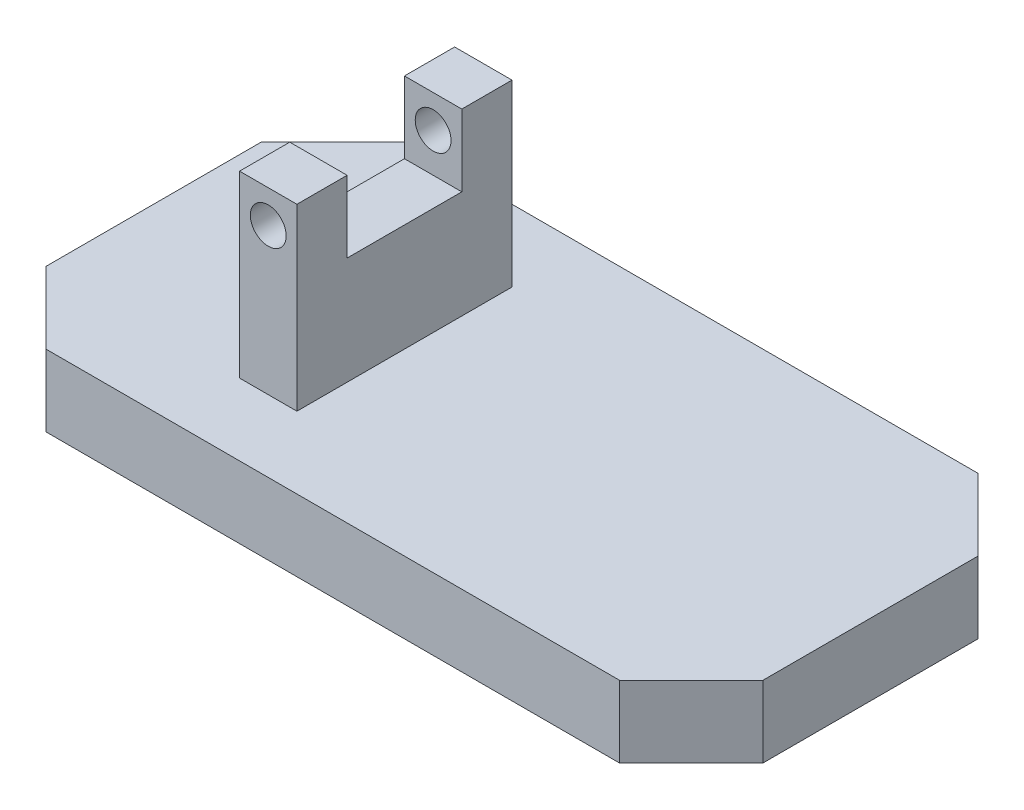
ISO-10303-21;
HEADER;
FILE_DESCRIPTION(('STEP AP214'),'2;1');
FILE_NAME('part.step','',(''),(''),'','','');
FILE_SCHEMA(('AUTOMOTIVE_DESIGN { 1 0 10303 214 1 1 1 1 }'));
ENDSEC;
DATA;
#1=APPLICATION_CONTEXT('core data for automotive mechanical design processes');
#2=APPLICATION_PROTOCOL_DEFINITION('international standard','automotive_design',2000,#1);
#3=PRODUCT_CONTEXT('',#1,'mechanical');
#4=PRODUCT('Part','Part','',(#3));
#5=PRODUCT_RELATED_PRODUCT_CATEGORY('part','',(#4));
#6=PRODUCT_DEFINITION_FORMATION('','',#4);
#7=PRODUCT_DEFINITION_CONTEXT('part definition',#1,'design');
#8=PRODUCT_DEFINITION('design','',#6,#7);
#9=PRODUCT_DEFINITION_SHAPE('','',#8);
#10=(LENGTH_UNIT() NAMED_UNIT(*) SI_UNIT(.MILLI.,.METRE.));
#11=(NAMED_UNIT(*) PLANE_ANGLE_UNIT() SI_UNIT($,.RADIAN.));
#12=(NAMED_UNIT(*) SI_UNIT($,.STERADIAN.) SOLID_ANGLE_UNIT());
#13=UNCERTAINTY_MEASURE_WITH_UNIT(LENGTH_MEASURE(1.E-05),#10,'distance_accuracy_value','');
#14=(GEOMETRIC_REPRESENTATION_CONTEXT(3) GLOBAL_UNCERTAINTY_ASSIGNED_CONTEXT((#13)) GLOBAL_UNIT_ASSIGNED_CONTEXT((#10,
#11,#12)) REPRESENTATION_CONTEXT('',''));
#15=CARTESIAN_POINT('',(0.,0.,0.));
#16=DIRECTION('',(0.,0.,1.));
#17=DIRECTION('',(1.,0.,0.));
#18=AXIS2_PLACEMENT_3D('',#15,#16,#17);
#19=CARTESIAN_POINT('',(0.,35.,0.));
#20=DIRECTION('',(0.,1.,0.));
#21=DIRECTION('',(0.,0.,1.));
#22=AXIS2_PLACEMENT_3D('',#19,#20,#21);
#23=PLANE('',#22);
#24=DIRECTION('',(-1.,0.,0.));
#25=VECTOR('',#24,1.);
#26=CARTESIAN_POINT('',(0.,35.,-8.));
#27=LINE('',#26,#25);
#28=CARTESIAN_POINT('',(-15.,35.,-8.));
#29=VERTEX_POINT('',#28);
#30=CARTESIAN_POINT('',(-23.,35.,-8.));
#31=VERTEX_POINT('',#30);
#32=EDGE_CURVE('E56',#29,#31,#27,.T.);
#33=ORIENTED_EDGE('',*,*,#32,.F.);
#34=DIRECTION('',(0.,0.,-1.));
#35=VECTOR('',#34,1.);
#36=CARTESIAN_POINT('',(-15.,35.,-15.));
#37=LINE('',#36,#35);
#38=CARTESIAN_POINT('',(-15.,35.,-15.));
#39=VERTEX_POINT('',#38);
#40=EDGE_CURVE('E187',#29,#39,#37,.T.);
#41=ORIENTED_EDGE('',*,*,#40,.T.);
#42=DIRECTION('',(-1.,0.,0.));
#43=VECTOR('',#42,1.);
#44=CARTESIAN_POINT('',(-23.,35.,-15.));
#45=LINE('',#44,#43);
#46=CARTESIAN_POINT('',(-23.,35.,-15.));
#47=VERTEX_POINT('',#46);
#48=EDGE_CURVE('E186',#39,#47,#45,.T.);
#49=ORIENTED_EDGE('',*,*,#48,.T.);
#50=DIRECTION('',(0.,0.,1.));
#51=VECTOR('',#50,1.);
#52=CARTESIAN_POINT('',(-23.,35.,-15.));
#53=LINE('',#52,#51);
#54=EDGE_CURVE('E320',#47,#31,#53,.T.);
#55=ORIENTED_EDGE('',*,*,#54,.T.);
#56=EDGE_LOOP('',(#33,#41,#49,#55));
#57=FACE_BOUND('',#56,.T.);
#58=ADVANCED_FACE('F45',(#57),#23,.T.);
#59=CARTESIAN_POINT('',(0.,10.,0.));
#60=DIRECTION('',(0.,1.,0.));
#61=DIRECTION('',(0.,0.,1.));
#62=AXIS2_PLACEMENT_3D('',#59,#60,#61);
#63=PLANE('',#62);
#64=DIRECTION('',(-1.,0.,0.));
#65=VECTOR('',#64,1.);
#66=CARTESIAN_POINT('',(-50.,10.,-25.));
#67=LINE('',#66,#65);
#68=CARTESIAN_POINT('',(40.,10.,-25.));
#69=VERTEX_POINT('',#68);
#70=CARTESIAN_POINT('',(-40.,10.,-25.));
#71=VERTEX_POINT('',#70);
#72=EDGE_CURVE('E236',#69,#71,#67,.T.);
#73=ORIENTED_EDGE('',*,*,#72,.T.);
#74=DIRECTION('',(0.707106781186549,0.,-0.707106781186547));
#75=VECTOR('',#74,1.);
#76=CARTESIAN_POINT('',(-32.4999999999999,10.,-32.5));
#77=LINE('',#76,#75);
#78=CARTESIAN_POINT('',(-50.,10.,-15.));
#79=VERTEX_POINT('',#78);
#80=EDGE_CURVE('E289',#71,#79,#77,.F.);
#81=ORIENTED_EDGE('',*,*,#80,.T.);
#82=DIRECTION('',(0.,0.,1.));
#83=VECTOR('',#82,1.);
#84=CARTESIAN_POINT('',(-50.,10.,-25.));
#85=LINE('',#84,#83);
#86=CARTESIAN_POINT('',(-50.,10.,15.));
#87=VERTEX_POINT('',#86);
#88=EDGE_CURVE('E223',#79,#87,#85,.T.);
#89=ORIENTED_EDGE('',*,*,#88,.T.);
#90=DIRECTION('',(-0.707106781186546,0.,-0.707106781186549));
#91=VECTOR('',#90,1.);
#92=CARTESIAN_POINT('',(-32.5000000000001,10.,32.5));
#93=LINE('',#92,#91);
#94=CARTESIAN_POINT('',(-40.,10.,25.));
#95=VERTEX_POINT('',#94);
#96=EDGE_CURVE('E286',#87,#95,#93,.F.);
#97=ORIENTED_EDGE('',*,*,#96,.T.);
#98=DIRECTION('',(1.,0.,0.));
#99=VECTOR('',#98,1.);
#100=CARTESIAN_POINT('',(-50.,10.,25.));
#101=LINE('',#100,#99);
#102=CARTESIAN_POINT('',(39.9999999999999,10.,25.));
#103=VERTEX_POINT('',#102);
#104=EDGE_CURVE('E227',#95,#103,#101,.T.);
#105=ORIENTED_EDGE('',*,*,#104,.T.);
#106=DIRECTION('',(-0.707106781186549,0.,0.707106781186546));
#107=VECTOR('',#106,1.);
#108=CARTESIAN_POINT('',(32.4999999999999,10.,32.5));
#109=LINE('',#108,#107);
#110=CARTESIAN_POINT('',(50.,10.,15.));
#111=VERTEX_POINT('',#110);
#112=EDGE_CURVE('E280',#103,#111,#109,.F.);
#113=ORIENTED_EDGE('',*,*,#112,.T.);
#114=DIRECTION('',(0.,0.,-1.));
#115=VECTOR('',#114,1.);
#116=CARTESIAN_POINT('',(50.,10.,-25.));
#117=LINE('',#116,#115);
#118=CARTESIAN_POINT('',(50.,10.,-15.));
#119=VERTEX_POINT('',#118);
#120=EDGE_CURVE('E232',#111,#119,#117,.T.);
#121=ORIENTED_EDGE('',*,*,#120,.T.);
#122=DIRECTION('',(0.707106781186547,0.,0.707106781186549));
#123=VECTOR('',#122,1.);
#124=CARTESIAN_POINT('',(32.5,10.,-32.5));
#125=LINE('',#124,#123);
#126=EDGE_CURVE('E283',#119,#69,#125,.F.);
#127=ORIENTED_EDGE('',*,*,#126,.T.);
#128=EDGE_LOOP('',(#73,#81,#89,#97,#105,#113,#121,#127));
#129=FACE_BOUND('',#128,.T.);
#130=DIRECTION('',(1.,0.,0.));
#131=VECTOR('',#130,1.);
#132=CARTESIAN_POINT('',(-23.,10.,15.));
#133=LINE('',#132,#131);
#134=CARTESIAN_POINT('',(-23.,10.,15.));
#135=VERTEX_POINT('',#134);
#136=CARTESIAN_POINT('',(-15.,10.,15.));
#137=VERTEX_POINT('',#136);
#138=EDGE_CURVE('E200',#135,#137,#133,.T.);
#139=ORIENTED_EDGE('',*,*,#138,.F.);
#140=DIRECTION('',(0.,0.,1.));
#141=VECTOR('',#140,1.);
#142=CARTESIAN_POINT('',(-23.,10.,-15.));
#143=LINE('',#142,#141);
#144=CARTESIAN_POINT('',(-23.,10.,-15.));
#145=VERTEX_POINT('',#144);
#146=EDGE_CURVE('E196',#145,#135,#143,.T.);
#147=ORIENTED_EDGE('',*,*,#146,.F.);
#148=DIRECTION('',(-1.,0.,0.));
#149=VECTOR('',#148,1.);
#150=CARTESIAN_POINT('',(-23.,10.,-15.));
#151=LINE('',#150,#149);
#152=CARTESIAN_POINT('',(-15.,10.,-15.));
#153=VERTEX_POINT('',#152);
#154=EDGE_CURVE('E207',#153,#145,#151,.T.);
#155=ORIENTED_EDGE('',*,*,#154,.F.);
#156=DIRECTION('',(0.,0.,-1.));
#157=VECTOR('',#156,1.);
#158=CARTESIAN_POINT('',(-15.,10.,-15.));
#159=LINE('',#158,#157);
#160=EDGE_CURVE('E204',#137,#153,#159,.T.);
#161=ORIENTED_EDGE('',*,*,#160,.F.);
#162=EDGE_LOOP('',(#139,#147,#155,#161));
#163=FACE_BOUND('',#162,.T.);
#164=ADVANCED_FACE('F369',(#129,#163),#63,.T.);
#165=CARTESIAN_POINT('',(-50.,10.,-25.));
#166=DIRECTION('',(1.,0.,0.));
#167=DIRECTION('',(0.,0.,-1.));
#168=AXIS2_PLACEMENT_3D('',#165,#166,#167);
#169=PLANE('',#168);
#170=ORIENTED_EDGE('',*,*,#88,.F.);
#171=DIRECTION('',(0.,-1.,0.));
#172=VECTOR('',#171,1.);
#173=CARTESIAN_POINT('',(-50.,10.,-15.));
#174=LINE('',#173,#172);
#175=CARTESIAN_POINT('',(-50.,0.,-15.));
#176=VERTEX_POINT('',#175);
#177=EDGE_CURVE('E257',#79,#176,#174,.T.);
#178=ORIENTED_EDGE('',*,*,#177,.T.);
#179=DIRECTION('',(0.,0.,1.));
#180=VECTOR('',#179,1.);
#181=CARTESIAN_POINT('',(-50.,0.,-25.));
#182=LINE('',#181,#180);
#183=CARTESIAN_POINT('',(-50.,0.,15.));
#184=VERTEX_POINT('',#183);
#185=EDGE_CURVE('E222',#176,#184,#182,.T.);
#186=ORIENTED_EDGE('',*,*,#185,.T.);
#187=DIRECTION('',(0.,1.,0.));
#188=VECTOR('',#187,1.);
#189=CARTESIAN_POINT('',(-50.,10.,15.));
#190=LINE('',#189,#188);
#191=EDGE_CURVE('E240',#184,#87,#190,.T.);
#192=ORIENTED_EDGE('',*,*,#191,.T.);
#193=EDGE_LOOP('',(#170,#178,#186,#192));
#194=FACE_BOUND('',#193,.T.);
#195=ADVANCED_FACE('F374',(#194),#169,.F.);
#196=CARTESIAN_POINT('',(-50.,10.,25.));
#197=DIRECTION('',(0.,0.,-1.));
#198=DIRECTION('',(-1.,0.,0.));
#199=AXIS2_PLACEMENT_3D('',#196,#197,#198);
#200=PLANE('',#199);
#201=ORIENTED_EDGE('',*,*,#104,.F.);
#202=DIRECTION('',(0.,-1.,0.));
#203=VECTOR('',#202,1.);
#204=CARTESIAN_POINT('',(-40.,10.,25.));
#205=LINE('',#204,#203);
#206=CARTESIAN_POINT('',(-40.,0.,25.));
#207=VERTEX_POINT('',#206);
#208=EDGE_CURVE('E295',#95,#207,#205,.T.);
#209=ORIENTED_EDGE('',*,*,#208,.T.);
#210=DIRECTION('',(1.,0.,0.));
#211=VECTOR('',#210,1.);
#212=CARTESIAN_POINT('',(-50.,0.,25.));
#213=LINE('',#212,#211);
#214=CARTESIAN_POINT('',(39.9999999999999,0.,25.));
#215=VERTEX_POINT('',#214);
#216=EDGE_CURVE('E244',#207,#215,#213,.T.);
#217=ORIENTED_EDGE('',*,*,#216,.T.);
#218=DIRECTION('',(0.,1.,0.));
#219=VECTOR('',#218,1.);
#220=CARTESIAN_POINT('',(39.9999999999999,10.,25.));
#221=LINE('',#220,#219);
#222=EDGE_CURVE('E292',#215,#103,#221,.T.);
#223=ORIENTED_EDGE('',*,*,#222,.T.);
#224=EDGE_LOOP('',(#201,#209,#217,#223));
#225=FACE_BOUND('',#224,.T.);
#226=ADVANCED_FACE('F410',(#225),#200,.F.);
#227=CARTESIAN_POINT('',(50.,10.,-25.));
#228=DIRECTION('',(-1.,0.,0.));
#229=DIRECTION('',(0.,0.,1.));
#230=AXIS2_PLACEMENT_3D('',#227,#228,#229);
#231=PLANE('',#230);
#232=DIRECTION('',(0.,0.,-1.));
#233=VECTOR('',#232,1.);
#234=CARTESIAN_POINT('',(50.,0.,-25.));
#235=LINE('',#234,#233);
#236=CARTESIAN_POINT('',(50.,0.,15.));
#237=VERTEX_POINT('',#236);
#238=CARTESIAN_POINT('',(50.,0.,-15.));
#239=VERTEX_POINT('',#238);
#240=EDGE_CURVE('E248',#237,#239,#235,.T.);
#241=ORIENTED_EDGE('',*,*,#240,.T.);
#242=DIRECTION('',(0.,1.,0.));
#243=VECTOR('',#242,1.);
#244=CARTESIAN_POINT('',(50.,10.,-15.));
#245=LINE('',#244,#243);
#246=EDGE_CURVE('E168',#239,#119,#245,.T.);
#247=ORIENTED_EDGE('',*,*,#246,.T.);
#248=ORIENTED_EDGE('',*,*,#120,.F.);
#249=DIRECTION('',(0.,-1.,0.));
#250=VECTOR('',#249,1.);
#251=CARTESIAN_POINT('',(50.,10.,15.));
#252=LINE('',#251,#250);
#253=EDGE_CURVE('E299',#111,#237,#252,.T.);
#254=ORIENTED_EDGE('',*,*,#253,.T.);
#255=EDGE_LOOP('',(#241,#247,#248,#254));
#256=FACE_BOUND('',#255,.T.);
#257=ADVANCED_FACE('F406',(#256),#231,.F.);
#258=CARTESIAN_POINT('',(-50.,10.,-25.));
#259=DIRECTION('',(0.,0.,1.));
#260=DIRECTION('',(1.,0.,0.));
#261=AXIS2_PLACEMENT_3D('',#258,#259,#260);
#262=PLANE('',#261);
#263=DIRECTION('',(-1.,0.,0.));
#264=VECTOR('',#263,1.);
#265=CARTESIAN_POINT('',(-50.,0.,-25.));
#266=LINE('',#265,#264);
#267=CARTESIAN_POINT('',(40.,0.,-25.));
#268=VERTEX_POINT('',#267);
#269=CARTESIAN_POINT('',(-40.,0.,-25.));
#270=VERTEX_POINT('',#269);
#271=EDGE_CURVE('E228',#268,#270,#266,.T.);
#272=ORIENTED_EDGE('',*,*,#271,.T.);
#273=DIRECTION('',(0.,1.,0.));
#274=VECTOR('',#273,1.);
#275=CARTESIAN_POINT('',(-40.,10.,-25.));
#276=LINE('',#275,#274);
#277=EDGE_CURVE('E277',#270,#71,#276,.T.);
#278=ORIENTED_EDGE('',*,*,#277,.T.);
#279=ORIENTED_EDGE('',*,*,#72,.F.);
#280=DIRECTION('',(0.,-1.,0.));
#281=VECTOR('',#280,1.);
#282=CARTESIAN_POINT('',(40.,10.,-25.));
#283=LINE('',#282,#281);
#284=EDGE_CURVE('E273',#69,#268,#283,.T.);
#285=ORIENTED_EDGE('',*,*,#284,.T.);
#286=EDGE_LOOP('',(#272,#278,#279,#285));
#287=FACE_BOUND('',#286,.T.);
#288=ADVANCED_FACE('F402',(#287),#262,.F.);
#289=CARTESIAN_POINT('',(0.,0.,0.));
#290=DIRECTION('',(0.,1.,0.));
#291=DIRECTION('',(0.,0.,1.));
#292=AXIS2_PLACEMENT_3D('',#289,#290,#291);
#293=PLANE('',#292);
#294=ORIENTED_EDGE('',*,*,#185,.F.);
#295=DIRECTION('',(-0.707106781186549,0.,0.707106781186547));
#296=VECTOR('',#295,1.);
#297=CARTESIAN_POINT('',(-50.,0.,-15.));
#298=LINE('',#297,#296);
#299=EDGE_CURVE('E270',#176,#270,#298,.F.);
#300=ORIENTED_EDGE('',*,*,#299,.T.);
#301=ORIENTED_EDGE('',*,*,#271,.F.);
#302=DIRECTION('',(-0.707106781186547,0.,-0.707106781186549));
#303=VECTOR('',#302,1.);
#304=CARTESIAN_POINT('',(40.,0.,-25.));
#305=LINE('',#304,#303);
#306=EDGE_CURVE('E264',#268,#239,#305,.F.);
#307=ORIENTED_EDGE('',*,*,#306,.T.);
#308=ORIENTED_EDGE('',*,*,#240,.F.);
#309=DIRECTION('',(0.707106781186549,0.,-0.707106781186546));
#310=VECTOR('',#309,1.);
#311=CARTESIAN_POINT('',(50.,0.,15.));
#312=LINE('',#311,#310);
#313=EDGE_CURVE('E261',#237,#215,#312,.F.);
#314=ORIENTED_EDGE('',*,*,#313,.T.);
#315=ORIENTED_EDGE('',*,*,#216,.F.);
#316=DIRECTION('',(0.707106781186546,0.,0.707106781186549));
#317=VECTOR('',#316,1.);
#318=CARTESIAN_POINT('',(-40.,0.,25.));
#319=LINE('',#318,#317);
#320=EDGE_CURVE('E267',#207,#184,#319,.F.);
#321=ORIENTED_EDGE('',*,*,#320,.T.);
#322=EDGE_LOOP('',(#294,#300,#301,#307,#308,#314,#315,#321));
#323=FACE_BOUND('',#322,.T.);
#324=ADVANCED_FACE('F398',(#323),#293,.F.);
#325=CARTESIAN_POINT('',(-50.,10.,-15.));
#326=DIRECTION('',(0.707106781186547,0.,0.707106781186549));
#327=DIRECTION('',(0.,-1.,0.));
#328=AXIS2_PLACEMENT_3D('',#325,#326,#327);
#329=PLANE('',#328);
#330=ORIENTED_EDGE('',*,*,#80,.F.);
#331=ORIENTED_EDGE('',*,*,#277,.F.);
#332=ORIENTED_EDGE('',*,*,#299,.F.);
#333=ORIENTED_EDGE('',*,*,#177,.F.);
#334=EDGE_LOOP('',(#330,#331,#332,#333));
#335=FACE_BOUND('',#334,.T.);
#336=ADVANCED_FACE('F401',(#335),#329,.F.);
#337=CARTESIAN_POINT('',(-40.,10.,25.));
#338=DIRECTION('',(0.707106781186549,0.,-0.707106781186546));
#339=DIRECTION('',(0.,-1.,0.));
#340=AXIS2_PLACEMENT_3D('',#337,#338,#339);
#341=PLANE('',#340);
#342=ORIENTED_EDGE('',*,*,#96,.F.);
#343=ORIENTED_EDGE('',*,*,#191,.F.);
#344=ORIENTED_EDGE('',*,*,#320,.F.);
#345=ORIENTED_EDGE('',*,*,#208,.F.);
#346=EDGE_LOOP('',(#342,#343,#344,#345));
#347=FACE_BOUND('',#346,.T.);
#348=ADVANCED_FACE('F424',(#347),#341,.F.);
#349=CARTESIAN_POINT('',(40.,10.,-25.));
#350=DIRECTION('',(-0.707106781186549,0.,0.707106781186547));
#351=DIRECTION('',(0.,-1.,0.));
#352=AXIS2_PLACEMENT_3D('',#349,#350,#351);
#353=PLANE('',#352);
#354=ORIENTED_EDGE('',*,*,#126,.F.);
#355=ORIENTED_EDGE('',*,*,#246,.F.);
#356=ORIENTED_EDGE('',*,*,#306,.F.);
#357=ORIENTED_EDGE('',*,*,#284,.F.);
#358=EDGE_LOOP('',(#354,#355,#356,#357));
#359=FACE_BOUND('',#358,.T.);
#360=ADVANCED_FACE('F430',(#359),#353,.F.);
#361=CARTESIAN_POINT('',(50.,10.,15.));
#362=DIRECTION('',(-0.707106781186546,0.,-0.707106781186549));
#363=DIRECTION('',(0.,-1.,0.));
#364=AXIS2_PLACEMENT_3D('',#361,#362,#363);
#365=PLANE('',#364);
#366=ORIENTED_EDGE('',*,*,#112,.F.);
#367=ORIENTED_EDGE('',*,*,#222,.F.);
#368=ORIENTED_EDGE('',*,*,#313,.F.);
#369=ORIENTED_EDGE('',*,*,#253,.F.);
#370=EDGE_LOOP('',(#366,#367,#368,#369));
#371=FACE_BOUND('',#370,.T.);
#372=ADVANCED_FACE('F48',(#371),#365,.F.);
#373=CARTESIAN_POINT('',(-23.,35.,-15.));
#374=DIRECTION('',(1.,0.,0.));
#375=DIRECTION('',(0.,0.,-1.));
#376=AXIS2_PLACEMENT_3D('',#373,#374,#375);
#377=PLANE('',#376);
#378=DIRECTION('',(0.,0.,1.));
#379=VECTOR('',#378,1.);
#380=CARTESIAN_POINT('',(-23.,25.,-15.));
#381=LINE('',#380,#379);
#382=CARTESIAN_POINT('',(-23.,25.,-8.));
#383=VERTEX_POINT('',#382);
#384=CARTESIAN_POINT('',(-23.,25.,8.));
#385=VERTEX_POINT('',#384);
#386=EDGE_CURVE('E201',#383,#385,#381,.T.);
#387=ORIENTED_EDGE('',*,*,#386,.F.);
#388=DIRECTION('',(0.,1.,0.));
#389=VECTOR('',#388,1.);
#390=CARTESIAN_POINT('',(-23.,35.,-8.));
#391=LINE('',#390,#389);
#392=EDGE_CURVE('E311',#383,#31,#391,.T.);
#393=ORIENTED_EDGE('',*,*,#392,.T.);
#394=ORIENTED_EDGE('',*,*,#54,.F.);
#395=DIRECTION('',(0.,-1.,0.));
#396=VECTOR('',#395,1.);
#397=CARTESIAN_POINT('',(-23.,35.,-15.));
#398=LINE('',#397,#396);
#399=EDGE_CURVE('E191',#47,#145,#398,.T.);
#400=ORIENTED_EDGE('',*,*,#399,.T.);
#401=ORIENTED_EDGE('',*,*,#146,.T.);
#402=DIRECTION('',(0.,-1.,0.));
#403=VECTOR('',#402,1.);
#404=CARTESIAN_POINT('',(-23.,35.,15.));
#405=LINE('',#404,#403);
#406=CARTESIAN_POINT('',(-23.,35.,15.));
#407=VERTEX_POINT('',#406);
#408=EDGE_CURVE('E219',#407,#135,#405,.T.);
#409=ORIENTED_EDGE('',*,*,#408,.F.);
#410=CARTESIAN_POINT('',(-23.,35.,8.));
#411=VERTEX_POINT('',#410);
#412=EDGE_CURVE('E210',#411,#407,#53,.T.);
#413=ORIENTED_EDGE('',*,*,#412,.F.);
#414=DIRECTION('',(0.,-1.,0.));
#415=VECTOR('',#414,1.);
#416=CARTESIAN_POINT('',(-23.,35.,8.));
#417=LINE('',#416,#415);
#418=EDGE_CURVE('E63',#411,#385,#417,.T.);
#419=ORIENTED_EDGE('',*,*,#418,.T.);
#420=EDGE_LOOP('',(#387,#393,#394,#400,#401,#409,#413,#419));
#421=FACE_BOUND('',#420,.T.);
#422=ADVANCED_FACE('F319',(#421),#377,.F.);
#423=CARTESIAN_POINT('',(-23.,35.,15.));
#424=DIRECTION('',(0.,0.,-1.));
#425=DIRECTION('',(-1.,0.,0.));
#426=AXIS2_PLACEMENT_3D('',#423,#424,#425);
#427=PLANE('',#426);
#428=CARTESIAN_POINT('',(-19.,30.4286384577808,15.));
#429=DIRECTION('',(0.,0.,1.));
#430=DIRECTION('',(1.,0.,0.));
#431=AXIS2_PLACEMENT_3D('',#428,#429,#430);
#432=CIRCLE('',#431,2.5);
#433=CARTESIAN_POINT('',(-16.5,30.4286384577808,15.));
#434=VERTEX_POINT('',#433);
#435=EDGE_CURVE('E347',#434,#434,#432,.T.);
#436=ORIENTED_EDGE('',*,*,#435,.F.);
#437=EDGE_LOOP('',(#436));
#438=FACE_BOUND('',#437,.T.);
#439=ORIENTED_EDGE('',*,*,#138,.T.);
#440=DIRECTION('',(0.,-1.,0.));
#441=VECTOR('',#440,1.);
#442=CARTESIAN_POINT('',(-15.,35.,15.));
#443=LINE('',#442,#441);
#444=CARTESIAN_POINT('',(-15.,35.,15.));
#445=VERTEX_POINT('',#444);
#446=EDGE_CURVE('E216',#445,#137,#443,.T.);
#447=ORIENTED_EDGE('',*,*,#446,.F.);
#448=DIRECTION('',(1.,0.,0.));
#449=VECTOR('',#448,1.);
#450=CARTESIAN_POINT('',(-23.,35.,15.));
#451=LINE('',#450,#449);
#452=EDGE_CURVE('E183',#407,#445,#451,.T.);
#453=ORIENTED_EDGE('',*,*,#452,.F.);
#454=ORIENTED_EDGE('',*,*,#408,.T.);
#455=EDGE_LOOP('',(#439,#447,#453,#454));
#456=FACE_BOUND('',#455,.T.);
#457=ADVANCED_FACE('F390',(#438,#456),#427,.F.);
#458=CARTESIAN_POINT('',(-15.,35.,-15.));
#459=DIRECTION('',(-1.,0.,0.));
#460=DIRECTION('',(0.,0.,1.));
#461=AXIS2_PLACEMENT_3D('',#458,#459,#460);
#462=PLANE('',#461);
#463=ORIENTED_EDGE('',*,*,#40,.F.);
#464=DIRECTION('',(0.,-1.,0.));
#465=VECTOR('',#464,1.);
#466=CARTESIAN_POINT('',(-15.,35.,-8.));
#467=LINE('',#466,#465);
#468=CARTESIAN_POINT('',(-15.,25.,-8.));
#469=VERTEX_POINT('',#468);
#470=EDGE_CURVE('E313',#29,#469,#467,.T.);
#471=ORIENTED_EDGE('',*,*,#470,.T.);
#472=DIRECTION('',(0.,0.,-1.));
#473=VECTOR('',#472,1.);
#474=CARTESIAN_POINT('',(-15.,25.,-15.));
#475=LINE('',#474,#473);
#476=CARTESIAN_POINT('',(-15.,25.,8.));
#477=VERTEX_POINT('',#476);
#478=EDGE_CURVE('E11',#477,#469,#475,.T.);
#479=ORIENTED_EDGE('',*,*,#478,.F.);
#480=DIRECTION('',(0.,1.,0.));
#481=VECTOR('',#480,1.);
#482=CARTESIAN_POINT('',(-15.,35.,8.));
#483=LINE('',#482,#481);
#484=CARTESIAN_POINT('',(-15.,35.,8.));
#485=VERTEX_POINT('',#484);
#486=EDGE_CURVE('E162',#477,#485,#483,.T.);
#487=ORIENTED_EDGE('',*,*,#486,.T.);
#488=EDGE_CURVE('E176',#445,#485,#37,.T.);
#489=ORIENTED_EDGE('',*,*,#488,.F.);
#490=ORIENTED_EDGE('',*,*,#446,.T.);
#491=ORIENTED_EDGE('',*,*,#160,.T.);
#492=DIRECTION('',(0.,-1.,0.));
#493=VECTOR('',#492,1.);
#494=CARTESIAN_POINT('',(-15.,35.,-15.));
#495=LINE('',#494,#493);
#496=EDGE_CURVE('E71',#39,#153,#495,.T.);
#497=ORIENTED_EDGE('',*,*,#496,.F.);
#498=EDGE_LOOP('',(#463,#471,#479,#487,#489,#490,#491,#497));
#499=FACE_BOUND('',#498,.T.);
#500=ADVANCED_FACE('F174',(#499),#462,.F.);
#501=CARTESIAN_POINT('',(-23.,35.,-15.));
#502=DIRECTION('',(0.,0.,1.));
#503=DIRECTION('',(1.,0.,0.));
#504=AXIS2_PLACEMENT_3D('',#501,#502,#503);
#505=PLANE('',#504);
#506=CARTESIAN_POINT('',(-19.,30.4286384577808,-15.));
#507=DIRECTION('',(0.,0.,1.));
#508=DIRECTION('',(1.,0.,0.));
#509=AXIS2_PLACEMENT_3D('',#506,#507,#508);
#510=CIRCLE('',#509,2.5);
#511=CARTESIAN_POINT('',(-16.5,30.4286384577808,-15.));
#512=VERTEX_POINT('',#511);
#513=EDGE_CURVE('E339',#512,#512,#510,.T.);
#514=ORIENTED_EDGE('',*,*,#513,.T.);
#515=EDGE_LOOP('',(#514));
#516=FACE_BOUND('',#515,.T.);
#517=ORIENTED_EDGE('',*,*,#154,.T.);
#518=ORIENTED_EDGE('',*,*,#399,.F.);
#519=ORIENTED_EDGE('',*,*,#48,.F.);
#520=ORIENTED_EDGE('',*,*,#496,.T.);
#521=EDGE_LOOP('',(#517,#518,#519,#520));
#522=FACE_BOUND('',#521,.T.);
#523=ADVANCED_FACE('F380',(#516,#522),#505,.F.);
#524=DIRECTION('',(1.,0.,0.));
#525=VECTOR('',#524,1.);
#526=CARTESIAN_POINT('',(0.,35.,8.));
#527=LINE('',#526,#525);
#528=EDGE_CURVE('E159',#411,#485,#527,.T.);
#529=ORIENTED_EDGE('',*,*,#528,.F.);
#530=ORIENTED_EDGE('',*,*,#412,.T.);
#531=ORIENTED_EDGE('',*,*,#452,.T.);
#532=ORIENTED_EDGE('',*,*,#488,.T.);
#533=EDGE_LOOP('',(#529,#530,#531,#532));
#534=FACE_BOUND('',#533,.T.);
#535=ADVANCED_FACE('F181',(#534),#23,.T.);
#536=CARTESIAN_POINT('',(0.,25.,0.));
#537=DIRECTION('',(0.,1.,0.));
#538=DIRECTION('',(0.,0.,1.));
#539=AXIS2_PLACEMENT_3D('',#536,#537,#538);
#540=PLANE('',#539);
#541=ORIENTED_EDGE('',*,*,#386,.T.);
#542=DIRECTION('',(1.,0.,0.));
#543=VECTOR('',#542,1.);
#544=CARTESIAN_POINT('',(-30.2480348481143,25.,8.));
#545=LINE('',#544,#543);
#546=EDGE_CURVE('E336',#385,#477,#545,.T.);
#547=ORIENTED_EDGE('',*,*,#546,.T.);
#548=ORIENTED_EDGE('',*,*,#478,.T.);
#549=DIRECTION('',(-1.,0.,0.));
#550=VECTOR('',#549,1.);
#551=CARTESIAN_POINT('',(-30.2480348481143,25.,-8.));
#552=LINE('',#551,#550);
#553=EDGE_CURVE('E179',#469,#383,#552,.T.);
#554=ORIENTED_EDGE('',*,*,#553,.T.);
#555=EDGE_LOOP('',(#541,#547,#548,#554));
#556=FACE_BOUND('',#555,.T.);
#557=ADVANCED_FACE('F379',(#556),#540,.T.);
#558=CARTESIAN_POINT('',(-30.2480348481143,25.,-8.));
#559=DIRECTION('',(0.,0.,-1.));
#560=DIRECTION('',(-1.,0.,0.));
#561=AXIS2_PLACEMENT_3D('',#558,#559,#560);
#562=PLANE('',#561);
#563=CARTESIAN_POINT('',(-19.,30.4286384577808,-8.));
#564=DIRECTION('',(0.,0.,-1.));
#565=DIRECTION('',(-1.,0.,0.));
#566=AXIS2_PLACEMENT_3D('',#563,#564,#565);
#567=CIRCLE('',#566,2.5);
#568=CARTESIAN_POINT('',(-21.5,30.4286384577808,-8.));
#569=VERTEX_POINT('',#568);
#570=EDGE_CURVE('E343',#569,#569,#567,.T.);
#571=ORIENTED_EDGE('',*,*,#570,.T.);
#572=EDGE_LOOP('',(#571));
#573=FACE_BOUND('',#572,.T.);
#574=ORIENTED_EDGE('',*,*,#553,.F.);
#575=ORIENTED_EDGE('',*,*,#470,.F.);
#576=ORIENTED_EDGE('',*,*,#32,.T.);
#577=ORIENTED_EDGE('',*,*,#392,.F.);
#578=EDGE_LOOP('',(#574,#575,#576,#577));
#579=FACE_BOUND('',#578,.T.);
#580=ADVANCED_FACE('F310',(#573,#579),#562,.F.);
#581=CARTESIAN_POINT('',(-30.2480348481143,25.,8.));
#582=DIRECTION('',(0.,0.,1.));
#583=DIRECTION('',(1.,0.,0.));
#584=AXIS2_PLACEMENT_3D('',#581,#582,#583);
#585=PLANE('',#584);
#586=CARTESIAN_POINT('',(-19.,30.4286384577808,8.));
#587=DIRECTION('',(0.,0.,1.));
#588=DIRECTION('',(1.,0.,0.));
#589=AXIS2_PLACEMENT_3D('',#586,#587,#588);
#590=CIRCLE('',#589,2.5);
#591=CARTESIAN_POINT('',(-16.5,30.4286384577808,8.));
#592=VERTEX_POINT('',#591);
#593=EDGE_CURVE('E50',#592,#592,#590,.T.);
#594=ORIENTED_EDGE('',*,*,#593,.T.);
#595=EDGE_LOOP('',(#594));
#596=FACE_BOUND('',#595,.T.);
#597=ORIENTED_EDGE('',*,*,#528,.T.);
#598=ORIENTED_EDGE('',*,*,#486,.F.);
#599=ORIENTED_EDGE('',*,*,#546,.F.);
#600=ORIENTED_EDGE('',*,*,#418,.F.);
#601=EDGE_LOOP('',(#597,#598,#599,#600));
#602=FACE_BOUND('',#601,.T.);
#603=ADVANCED_FACE('F161',(#596,#602),#585,.F.);
#604=CARTESIAN_POINT('',(-19.,30.4286384577808,-27.));
#605=DIRECTION('',(0.,0.,1.));
#606=DIRECTION('',(1.,0.,0.));
#607=AXIS2_PLACEMENT_3D('',#604,#605,#606);
#608=CYLINDRICAL_SURFACE('',#607,2.5);
#609=ORIENTED_EDGE('',*,*,#435,.T.);
#610=EDGE_LOOP('',(#609));
#611=FACE_BOUND('',#610,.T.);
#612=ORIENTED_EDGE('',*,*,#593,.F.);
#613=EDGE_LOOP('',(#612));
#614=FACE_BOUND('',#613,.T.);
#615=ADVANCED_FACE('F357',(#611,#614),#608,.F.);
#616=ORIENTED_EDGE('',*,*,#570,.F.);
#617=EDGE_LOOP('',(#616));
#618=FACE_BOUND('',#617,.T.);
#619=ORIENTED_EDGE('',*,*,#513,.F.);
#620=EDGE_LOOP('',(#619));
#621=FACE_BOUND('',#620,.T.);
#622=ADVANCED_FACE('F359',(#618,#621),#608,.F.);
#623=CLOSED_SHELL('',(#58,#164,#195,#226,#257,#288,#324,#336,#348,#360,#372,#422,#457,#500,#523,
#535,#557,#580,#603,#615,#622));
#624=MANIFOLD_SOLID_BREP('B2',#623);
#625=ADVANCED_BREP_SHAPE_REPRESENTATION('',(#18,#624),#14);
#626=SHAPE_DEFINITION_REPRESENTATION(#9,#625);
ENDSEC;
END-ISO-10303-21;
